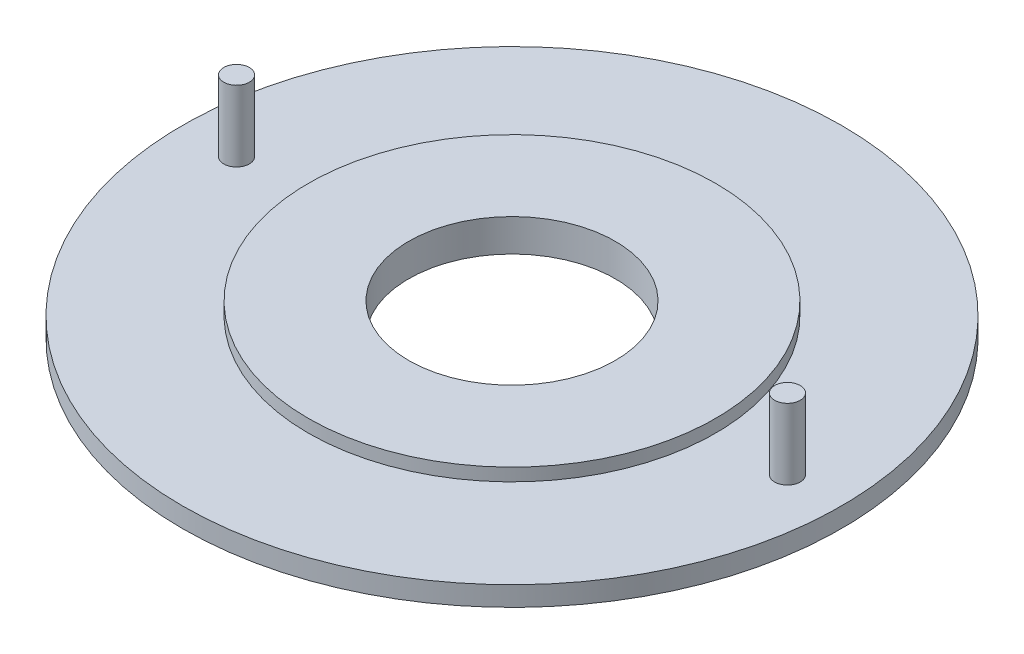
ISO-10303-21;
HEADER;
FILE_DESCRIPTION(('STEP AP214'),'2;1');
FILE_NAME('part.step','',(''),(''),'','','');
FILE_SCHEMA(('AUTOMOTIVE_DESIGN { 1 0 10303 214 1 1 1 1 }'));
ENDSEC;
DATA;
#1=APPLICATION_CONTEXT('core data for automotive mechanical design processes');
#2=APPLICATION_PROTOCOL_DEFINITION('international standard','automotive_design',2000,#1);
#3=PRODUCT_CONTEXT('',#1,'mechanical');
#4=PRODUCT('Part','Part','',(#3));
#5=PRODUCT_RELATED_PRODUCT_CATEGORY('part','',(#4));
#6=PRODUCT_DEFINITION_FORMATION('','',#4);
#7=PRODUCT_DEFINITION_CONTEXT('part definition',#1,'design');
#8=PRODUCT_DEFINITION('design','',#6,#7);
#9=PRODUCT_DEFINITION_SHAPE('','',#8);
#10=(LENGTH_UNIT() NAMED_UNIT(*) SI_UNIT(.MILLI.,.METRE.));
#11=(NAMED_UNIT(*) PLANE_ANGLE_UNIT() SI_UNIT($,.RADIAN.));
#12=(NAMED_UNIT(*) SI_UNIT($,.STERADIAN.) SOLID_ANGLE_UNIT());
#13=UNCERTAINTY_MEASURE_WITH_UNIT(LENGTH_MEASURE(1.E-05),#10,'distance_accuracy_value','');
#14=(GEOMETRIC_REPRESENTATION_CONTEXT(3) GLOBAL_UNCERTAINTY_ASSIGNED_CONTEXT((#13)) GLOBAL_UNIT_ASSIGNED_CONTEXT((#10,
#11,#12)) REPRESENTATION_CONTEXT('',''));
#15=CARTESIAN_POINT('',(0.,0.,0.));
#16=DIRECTION('',(0.,0.,1.));
#17=DIRECTION('',(1.,0.,0.));
#18=AXIS2_PLACEMENT_3D('',#15,#16,#17);
#19=CARTESIAN_POINT('',(0.,1.,0.));
#20=DIRECTION('',(0.,-1.,0.));
#21=DIRECTION('',(0.,0.,-1.));
#22=AXIS2_PLACEMENT_3D('',#19,#20,#21);
#23=CYLINDRICAL_SURFACE('',#22,16.75);
#24=CARTESIAN_POINT('',(0.,1.,0.));
#25=DIRECTION('',(0.,1.,0.));
#26=DIRECTION('',(0.,0.,1.));
#27=AXIS2_PLACEMENT_3D('',#24,#25,#26);
#28=CIRCLE('',#27,16.75);
#29=CARTESIAN_POINT('',(0.,1.,16.75));
#30=VERTEX_POINT('',#29);
#31=EDGE_CURVE('E39',#30,#30,#28,.T.);
#32=ORIENTED_EDGE('',*,*,#31,.F.);
#33=EDGE_LOOP('',(#32));
#34=FACE_BOUND('',#33,.T.);
#35=CARTESIAN_POINT('',(0.,0.,0.));
#36=DIRECTION('',(0.,1.,0.));
#37=DIRECTION('',(0.,0.,1.));
#38=AXIS2_PLACEMENT_3D('',#35,#36,#37);
#39=CIRCLE('',#38,16.75);
#40=CARTESIAN_POINT('',(0.,0.,16.75));
#41=VERTEX_POINT('',#40);
#42=EDGE_CURVE('E35',#41,#41,#39,.T.);
#43=ORIENTED_EDGE('',*,*,#42,.T.);
#44=EDGE_LOOP('',(#43));
#45=FACE_BOUND('',#44,.T.);
#46=ADVANCED_FACE('F32',(#34,#45),#23,.T.);
#47=CARTESIAN_POINT('',(0.,1.,0.));
#48=DIRECTION('',(0.,1.,0.));
#49=DIRECTION('',(0.,0.,1.));
#50=AXIS2_PLACEMENT_3D('',#47,#48,#49);
#51=PLANE('',#50);
#52=CARTESIAN_POINT('',(-13.9999720000001,1.,0.));
#53=DIRECTION('',(0.,1.,0.));
#54=DIRECTION('',(0.,0.,1.));
#55=AXIS2_PLACEMENT_3D('',#52,#53,#54);
#56=CIRCLE('',#55,0.649998499999987);
#57=CARTESIAN_POINT('',(-13.9999720000001,1.,0.649998499999987));
#58=VERTEX_POINT('',#57);
#59=EDGE_CURVE('E63',#58,#58,#56,.T.);
#60=ORIENTED_EDGE('',*,*,#59,.F.);
#61=EDGE_LOOP('',(#60));
#62=FACE_BOUND('',#61,.T.);
#63=CARTESIAN_POINT('',(14.0000228,1.,0.));
#64=DIRECTION('',(0.,1.,0.));
#65=DIRECTION('',(0.,0.,1.));
#66=AXIS2_PLACEMENT_3D('',#63,#64,#65);
#67=CIRCLE('',#66,0.649998499999987);
#68=CARTESIAN_POINT('',(14.0000228,1.,0.649998499999987));
#69=VERTEX_POINT('',#68);
#70=EDGE_CURVE('E57',#69,#69,#67,.T.);
#71=ORIENTED_EDGE('',*,*,#70,.F.);
#72=EDGE_LOOP('',(#71));
#73=FACE_BOUND('',#72,.T.);
#74=CARTESIAN_POINT('',(0.,1.,0.));
#75=DIRECTION('',(0.,1.,0.));
#76=DIRECTION('',(0.,0.,1.));
#77=AXIS2_PLACEMENT_3D('',#74,#75,#76);
#78=CIRCLE('',#77,10.35);
#79=CARTESIAN_POINT('',(0.,1.,10.35));
#80=VERTEX_POINT('',#79);
#81=EDGE_CURVE('E10',#80,#80,#78,.T.);
#82=ORIENTED_EDGE('',*,*,#81,.F.);
#83=EDGE_LOOP('',(#82));
#84=FACE_BOUND('',#83,.T.);
#85=ORIENTED_EDGE('',*,*,#31,.T.);
#86=EDGE_LOOP('',(#85));
#87=FACE_BOUND('',#86,.T.);
#88=ADVANCED_FACE('F70',(#62,#73,#84,#87),#51,.T.);
#89=CARTESIAN_POINT('',(0.,0.,0.));
#90=DIRECTION('',(0.,1.,0.));
#91=DIRECTION('',(0.,0.,1.));
#92=AXIS2_PLACEMENT_3D('',#89,#90,#91);
#93=PLANE('',#92);
#94=CARTESIAN_POINT('',(0.,0.,0.));
#95=DIRECTION('',(0.,1.,0.));
#96=DIRECTION('',(0.,0.,1.));
#97=AXIS2_PLACEMENT_3D('',#94,#95,#96);
#98=CIRCLE('',#97,5.25);
#99=CARTESIAN_POINT('',(0.,0.,5.25));
#100=VERTEX_POINT('',#99);
#101=EDGE_CURVE('E48',#100,#100,#98,.T.);
#102=ORIENTED_EDGE('',*,*,#101,.T.);
#103=EDGE_LOOP('',(#102));
#104=FACE_BOUND('',#103,.T.);
#105=ORIENTED_EDGE('',*,*,#42,.F.);
#106=EDGE_LOOP('',(#105));
#107=FACE_BOUND('',#106,.T.);
#108=ADVANCED_FACE('F73',(#104,#107),#93,.F.);
#109=CARTESIAN_POINT('',(0.,1.65,0.));
#110=DIRECTION('',(0.,-1.,0.));
#111=DIRECTION('',(0.,0.,-1.));
#112=AXIS2_PLACEMENT_3D('',#109,#110,#111);
#113=CYLINDRICAL_SURFACE('',#112,10.35);
#114=CARTESIAN_POINT('',(0.,1.65,0.));
#115=DIRECTION('',(0.,1.,0.));
#116=DIRECTION('',(0.,0.,1.));
#117=AXIS2_PLACEMENT_3D('',#114,#115,#116);
#118=CIRCLE('',#117,10.35);
#119=CARTESIAN_POINT('',(0.,1.65,10.35));
#120=VERTEX_POINT('',#119);
#121=EDGE_CURVE('E45',#120,#120,#118,.T.);
#122=ORIENTED_EDGE('',*,*,#121,.F.);
#123=EDGE_LOOP('',(#122));
#124=FACE_BOUND('',#123,.T.);
#125=ORIENTED_EDGE('',*,*,#81,.T.);
#126=EDGE_LOOP('',(#125));
#127=FACE_BOUND('',#126,.T.);
#128=ADVANCED_FACE('F86',(#124,#127),#113,.T.);
#129=CARTESIAN_POINT('',(0.,1.65,0.));
#130=DIRECTION('',(0.,1.,0.));
#131=DIRECTION('',(0.,0.,1.));
#132=AXIS2_PLACEMENT_3D('',#129,#130,#131);
#133=PLANE('',#132);
#134=CARTESIAN_POINT('',(0.,1.65,0.));
#135=DIRECTION('',(0.,1.,0.));
#136=DIRECTION('',(0.,0.,1.));
#137=AXIS2_PLACEMENT_3D('',#134,#135,#136);
#138=CIRCLE('',#137,5.25);
#139=CARTESIAN_POINT('',(0.,1.65,5.25));
#140=VERTEX_POINT('',#139);
#141=EDGE_CURVE('E49',#140,#140,#138,.T.);
#142=ORIENTED_EDGE('',*,*,#141,.F.);
#143=EDGE_LOOP('',(#142));
#144=FACE_BOUND('',#143,.T.);
#145=ORIENTED_EDGE('',*,*,#121,.T.);
#146=EDGE_LOOP('',(#145));
#147=FACE_BOUND('',#146,.T.);
#148=ADVANCED_FACE('F91',(#144,#147),#133,.T.);
#149=CARTESIAN_POINT('',(0.,0.,0.));
#150=DIRECTION('',(0.,1.,0.));
#151=DIRECTION('',(0.,0.,1.));
#152=AXIS2_PLACEMENT_3D('',#149,#150,#151);
#153=CYLINDRICAL_SURFACE('',#152,5.25);
#154=ORIENTED_EDGE('',*,*,#101,.F.);
#155=EDGE_LOOP('',(#154));
#156=FACE_BOUND('',#155,.T.);
#157=ORIENTED_EDGE('',*,*,#141,.T.);
#158=EDGE_LOOP('',(#157));
#159=FACE_BOUND('',#158,.T.);
#160=ADVANCED_FACE('F97',(#156,#159),#153,.F.);
#161=CARTESIAN_POINT('',(14.0000228,8.4384733884443,0.));
#162=DIRECTION('',(0.,-1.,0.));
#163=DIRECTION('',(0.,0.,-1.));
#164=AXIS2_PLACEMENT_3D('',#161,#162,#163);
#165=CYLINDRICAL_SURFACE('',#164,0.649998499999987);
#166=ORIENTED_EDGE('',*,*,#70,.T.);
#167=EDGE_LOOP('',(#166));
#168=FACE_BOUND('',#167,.T.);
#169=CARTESIAN_POINT('',(14.0000228,4.6,0.));
#170=DIRECTION('',(0.,1.,0.));
#171=DIRECTION('',(0.,0.,1.));
#172=AXIS2_PLACEMENT_3D('',#169,#170,#171);
#173=CIRCLE('',#172,0.649998499999987);
#174=CARTESIAN_POINT('',(14.0000228,4.6,0.649998499999987));
#175=VERTEX_POINT('',#174);
#176=EDGE_CURVE('E52',#175,#175,#173,.T.);
#177=ORIENTED_EDGE('',*,*,#176,.F.);
#178=EDGE_LOOP('',(#177));
#179=FACE_BOUND('',#178,.T.);
#180=ADVANCED_FACE('F101',(#168,#179),#165,.T.);
#181=CARTESIAN_POINT('',(-163.96937742,4.6,-38.56797722));
#182=DIRECTION('',(0.,1.,0.));
#183=DIRECTION('',(1.,0.,0.));
#184=AXIS2_PLACEMENT_3D('',#181,#182,#183);
#185=PLANE('',#184);
#186=ORIENTED_EDGE('',*,*,#176,.T.);
#187=EDGE_LOOP('',(#186));
#188=FACE_BOUND('',#187,.T.);
#189=ADVANCED_FACE('F103',(#188),#185,.T.);
#190=CARTESIAN_POINT('',(-13.9999720000001,8.4384733884443,0.));
#191=DIRECTION('',(0.,-1.,0.));
#192=DIRECTION('',(0.,0.,-1.));
#193=AXIS2_PLACEMENT_3D('',#190,#191,#192);
#194=CYLINDRICAL_SURFACE('',#193,0.649998499999987);
#195=ORIENTED_EDGE('',*,*,#59,.T.);
#196=EDGE_LOOP('',(#195));
#197=FACE_BOUND('',#196,.T.);
#198=CARTESIAN_POINT('',(-13.9999720000001,4.6,0.));
#199=DIRECTION('',(0.,1.,0.));
#200=DIRECTION('',(0.,0.,1.));
#201=AXIS2_PLACEMENT_3D('',#198,#199,#200);
#202=CIRCLE('',#201,0.649998499999987);
#203=CARTESIAN_POINT('',(-13.9999720000001,4.6,0.649998499999987));
#204=VERTEX_POINT('',#203);
#205=EDGE_CURVE('E60',#204,#204,#202,.T.);
#206=ORIENTED_EDGE('',*,*,#205,.F.);
#207=EDGE_LOOP('',(#206));
#208=FACE_BOUND('',#207,.T.);
#209=ADVANCED_FACE('F67',(#197,#208),#194,.T.);
#210=CARTESIAN_POINT('',(-163.96937742,4.6,-38.56797722));
#211=DIRECTION('',(0.,1.,0.));
#212=DIRECTION('',(1.,0.,0.));
#213=AXIS2_PLACEMENT_3D('',#210,#211,#212);
#214=PLANE('',#213);
#215=ORIENTED_EDGE('',*,*,#205,.T.);
#216=EDGE_LOOP('',(#215));
#217=FACE_BOUND('',#216,.T.);
#218=ADVANCED_FACE('F110',(#217),#214,.T.);
#219=CLOSED_SHELL('',(#46,#88,#108,#128,#148,#160,#180,#189,#209,#218));
#220=MANIFOLD_SOLID_BREP('B2',#219);
#221=ADVANCED_BREP_SHAPE_REPRESENTATION('',(#18,#220),#14);
#222=SHAPE_DEFINITION_REPRESENTATION(#9,#221);
ENDSEC;
END-ISO-10303-21;
